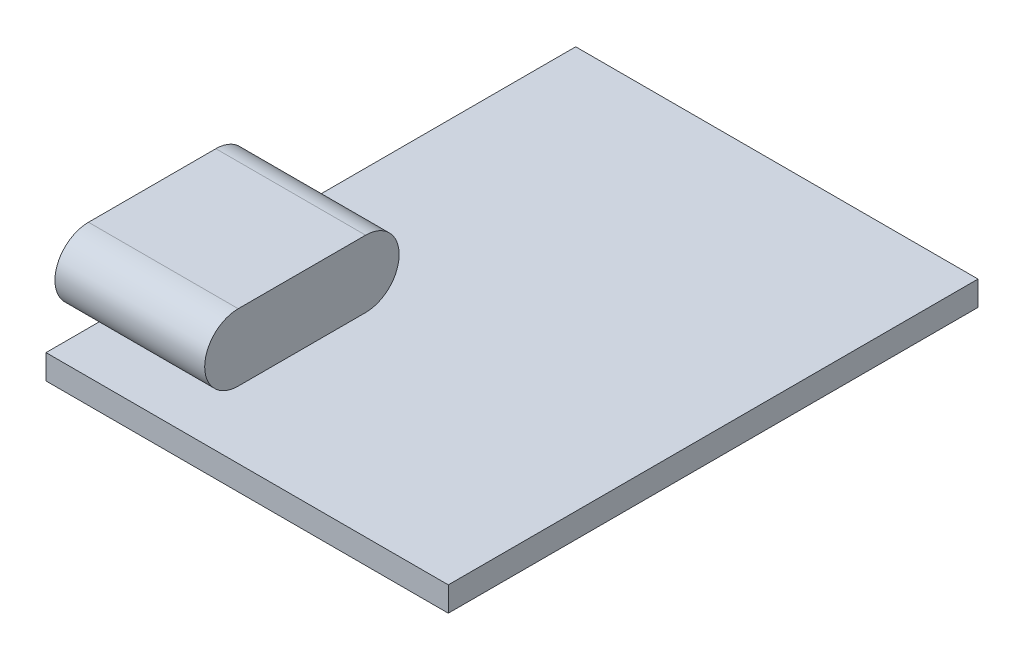
ISO-10303-21;
HEADER;
FILE_DESCRIPTION(('STEP AP214'),'2;1');
FILE_NAME('part.step','',(''),(''),'','','');
FILE_SCHEMA(('AUTOMOTIVE_DESIGN { 1 0 10303 214 1 1 1 1 }'));
ENDSEC;
DATA;
#1=APPLICATION_CONTEXT('core data for automotive mechanical design processes');
#2=APPLICATION_PROTOCOL_DEFINITION('international standard','automotive_design',2000,#1);
#3=PRODUCT_CONTEXT('',#1,'mechanical');
#4=PRODUCT('Part','Part','',(#3));
#5=PRODUCT_RELATED_PRODUCT_CATEGORY('part','',(#4));
#6=PRODUCT_DEFINITION_FORMATION('','',#4);
#7=PRODUCT_DEFINITION_CONTEXT('part definition',#1,'design');
#8=PRODUCT_DEFINITION('design','',#6,#7);
#9=PRODUCT_DEFINITION_SHAPE('','',#8);
#10=(LENGTH_UNIT() NAMED_UNIT(*) SI_UNIT(.MILLI.,.METRE.));
#11=(NAMED_UNIT(*) PLANE_ANGLE_UNIT() SI_UNIT($,.RADIAN.));
#12=(NAMED_UNIT(*) SI_UNIT($,.STERADIAN.) SOLID_ANGLE_UNIT());
#13=UNCERTAINTY_MEASURE_WITH_UNIT(LENGTH_MEASURE(1.E-05),#10,'distance_accuracy_value','');
#14=(GEOMETRIC_REPRESENTATION_CONTEXT(3) GLOBAL_UNCERTAINTY_ASSIGNED_CONTEXT((#13)) GLOBAL_UNIT_ASSIGNED_CONTEXT((#10,
#11,#12)) REPRESENTATION_CONTEXT('',''));
#15=CARTESIAN_POINT('',(0.,0.,0.));
#16=DIRECTION('',(0.,0.,1.));
#17=DIRECTION('',(1.,0.,0.));
#18=AXIS2_PLACEMENT_3D('',#15,#16,#17);
#19=CARTESIAN_POINT('',(0.,1.1,0.));
#20=DIRECTION('',(0.,-1.,0.));
#21=DIRECTION('',(0.,0.,-1.));
#22=AXIS2_PLACEMENT_3D('',#19,#20,#21);
#23=PLANE('',#22);
#24=DIRECTION('',(-1.,0.,0.));
#25=VECTOR('',#24,1.);
#26=CARTESIAN_POINT('',(5.6,1.1,-8.7));
#27=LINE('',#26,#25);
#28=CARTESIAN_POINT('',(5.6,1.1,-8.7));
#29=VERTEX_POINT('',#28);
#30=CARTESIAN_POINT('',(0.,1.1,-8.7));
#31=VERTEX_POINT('',#30);
#32=EDGE_CURVE('E113',#29,#31,#27,.T.);
#33=ORIENTED_EDGE('',*,*,#32,.F.);
#34=DIRECTION('',(0.,0.,1.));
#35=VECTOR('',#34,1.);
#36=CARTESIAN_POINT('',(5.6,1.1,-8.7));
#37=LINE('',#36,#35);
#38=CARTESIAN_POINT('',(5.6,1.1,-3.));
#39=VERTEX_POINT('',#38);
#40=EDGE_CURVE('E52',#29,#39,#37,.T.);
#41=ORIENTED_EDGE('',*,*,#40,.T.);
#42=DIRECTION('',(-1.,0.,0.));
#43=VECTOR('',#42,1.);
#44=CARTESIAN_POINT('',(5.6,1.1,-3.));
#45=LINE('',#44,#43);
#46=CARTESIAN_POINT('',(0.,1.1,-3.));
#47=VERTEX_POINT('',#46);
#48=EDGE_CURVE('E56',#39,#47,#45,.T.);
#49=ORIENTED_EDGE('',*,*,#48,.T.);
#50=DIRECTION('',(0.,0.,1.));
#51=VECTOR('',#50,1.);
#52=CARTESIAN_POINT('',(0.,1.1,0.));
#53=LINE('',#52,#51);
#54=CARTESIAN_POINT('',(0.,1.1,0.));
#55=VERTEX_POINT('',#54);
#56=EDGE_CURVE('E155',#47,#55,#53,.T.);
#57=ORIENTED_EDGE('',*,*,#56,.T.);
#58=DIRECTION('',(1.,0.,0.));
#59=VECTOR('',#58,1.);
#60=CARTESIAN_POINT('',(0.,1.1,0.));
#61=LINE('',#60,#59);
#62=CARTESIAN_POINT('',(18.,1.1,0.));
#63=VERTEX_POINT('',#62);
#64=EDGE_CURVE('E153',#55,#63,#61,.T.);
#65=ORIENTED_EDGE('',*,*,#64,.T.);
#66=DIRECTION('',(0.,0.,-1.));
#67=VECTOR('',#66,1.);
#68=CARTESIAN_POINT('',(18.,1.1,0.));
#69=LINE('',#68,#67);
#70=CARTESIAN_POINT('',(18.,1.1,-23.7));
#71=VERTEX_POINT('',#70);
#72=EDGE_CURVE('E157',#63,#71,#69,.T.);
#73=ORIENTED_EDGE('',*,*,#72,.T.);
#74=DIRECTION('',(-1.,0.,0.));
#75=VECTOR('',#74,1.);
#76=CARTESIAN_POINT('',(0.,1.1,-23.7));
#77=LINE('',#76,#75);
#78=CARTESIAN_POINT('',(0.,1.1,-23.7));
#79=VERTEX_POINT('',#78);
#80=EDGE_CURVE('E159',#71,#79,#77,.T.);
#81=ORIENTED_EDGE('',*,*,#80,.T.);
#82=EDGE_CURVE('E150',#79,#31,#53,.T.);
#83=ORIENTED_EDGE('',*,*,#82,.T.);
#84=EDGE_LOOP('',(#33,#41,#49,#57,#65,#73,#81,#83));
#85=FACE_BOUND('',#84,.T.);
#86=ADVANCED_FACE('F37',(#85),#23,.F.);
#87=CARTESIAN_POINT('',(0.,1.1,0.));
#88=DIRECTION('',(1.,0.,0.));
#89=DIRECTION('',(0.,0.,-1.));
#90=AXIS2_PLACEMENT_3D('',#87,#88,#89);
#91=PLANE('',#90);
#92=DIRECTION('',(0.,0.,1.));
#93=VECTOR('',#92,1.);
#94=CARTESIAN_POINT('',(0.,0.,0.));
#95=LINE('',#94,#93);
#96=CARTESIAN_POINT('',(0.,0.,-23.7));
#97=VERTEX_POINT('',#96);
#98=CARTESIAN_POINT('',(0.,0.,0.));
#99=VERTEX_POINT('',#98);
#100=EDGE_CURVE('E146',#97,#99,#95,.T.);
#101=ORIENTED_EDGE('',*,*,#100,.T.);
#102=DIRECTION('',(0.,-1.,0.));
#103=VECTOR('',#102,1.);
#104=CARTESIAN_POINT('',(0.,1.1,0.));
#105=LINE('',#104,#103);
#106=EDGE_CURVE('E11',#55,#99,#105,.T.);
#107=ORIENTED_EDGE('',*,*,#106,.F.);
#108=ORIENTED_EDGE('',*,*,#56,.F.);
#109=EDGE_CURVE('E154',#31,#47,#53,.T.);
#110=ORIENTED_EDGE('',*,*,#109,.F.);
#111=ORIENTED_EDGE('',*,*,#82,.F.);
#112=DIRECTION('',(0.,-1.,0.));
#113=VECTOR('',#112,1.);
#114=CARTESIAN_POINT('',(0.,1.1,-23.7));
#115=LINE('',#114,#113);
#116=EDGE_CURVE('E161',#79,#97,#115,.T.);
#117=ORIENTED_EDGE('',*,*,#116,.T.);
#118=EDGE_LOOP('',(#101,#107,#108,#110,#111,#117));
#119=FACE_BOUND('',#118,.T.);
#120=ADVANCED_FACE('F39',(#119),#91,.F.);
#121=CARTESIAN_POINT('',(0.,1.1,0.));
#122=DIRECTION('',(0.,0.,-1.));
#123=DIRECTION('',(-1.,0.,0.));
#124=AXIS2_PLACEMENT_3D('',#121,#122,#123);
#125=PLANE('',#124);
#126=DIRECTION('',(1.,0.,0.));
#127=VECTOR('',#126,1.);
#128=CARTESIAN_POINT('',(0.,0.,0.));
#129=LINE('',#128,#127);
#130=CARTESIAN_POINT('',(18.,0.,0.));
#131=VERTEX_POINT('',#130);
#132=EDGE_CURVE('E164',#99,#131,#129,.T.);
#133=ORIENTED_EDGE('',*,*,#132,.T.);
#134=DIRECTION('',(0.,-1.,0.));
#135=VECTOR('',#134,1.);
#136=CARTESIAN_POINT('',(18.,1.1,0.));
#137=LINE('',#136,#135);
#138=EDGE_CURVE('E45',#63,#131,#137,.T.);
#139=ORIENTED_EDGE('',*,*,#138,.F.);
#140=ORIENTED_EDGE('',*,*,#64,.F.);
#141=ORIENTED_EDGE('',*,*,#106,.T.);
#142=EDGE_LOOP('',(#133,#139,#140,#141));
#143=FACE_BOUND('',#142,.T.);
#144=ADVANCED_FACE('F194',(#143),#125,.F.);
#145=CARTESIAN_POINT('',(18.,1.1,0.));
#146=DIRECTION('',(-1.,0.,0.));
#147=DIRECTION('',(0.,0.,1.));
#148=AXIS2_PLACEMENT_3D('',#145,#146,#147);
#149=PLANE('',#148);
#150=DIRECTION('',(0.,0.,-1.));
#151=VECTOR('',#150,1.);
#152=CARTESIAN_POINT('',(18.,0.,0.));
#153=LINE('',#152,#151);
#154=CARTESIAN_POINT('',(18.,0.,-23.7));
#155=VERTEX_POINT('',#154);
#156=EDGE_CURVE('E166',#131,#155,#153,.T.);
#157=ORIENTED_EDGE('',*,*,#156,.T.);
#158=DIRECTION('',(0.,-1.,0.));
#159=VECTOR('',#158,1.);
#160=CARTESIAN_POINT('',(18.,1.1,-23.7));
#161=LINE('',#160,#159);
#162=EDGE_CURVE('E172',#71,#155,#161,.T.);
#163=ORIENTED_EDGE('',*,*,#162,.F.);
#164=ORIENTED_EDGE('',*,*,#72,.F.);
#165=ORIENTED_EDGE('',*,*,#138,.T.);
#166=EDGE_LOOP('',(#157,#163,#164,#165));
#167=FACE_BOUND('',#166,.T.);
#168=ADVANCED_FACE('F179',(#167),#149,.F.);
#169=CARTESIAN_POINT('',(0.,1.1,-23.7));
#170=DIRECTION('',(0.,0.,1.));
#171=DIRECTION('',(1.,0.,0.));
#172=AXIS2_PLACEMENT_3D('',#169,#170,#171);
#173=PLANE('',#172);
#174=DIRECTION('',(-1.,0.,0.));
#175=VECTOR('',#174,1.);
#176=CARTESIAN_POINT('',(0.,0.,-23.7));
#177=LINE('',#176,#175);
#178=EDGE_CURVE('E168',#155,#97,#177,.T.);
#179=ORIENTED_EDGE('',*,*,#178,.T.);
#180=ORIENTED_EDGE('',*,*,#116,.F.);
#181=ORIENTED_EDGE('',*,*,#80,.F.);
#182=ORIENTED_EDGE('',*,*,#162,.T.);
#183=EDGE_LOOP('',(#179,#180,#181,#182));
#184=FACE_BOUND('',#183,.T.);
#185=ADVANCED_FACE('F189',(#184),#173,.F.);
#186=CARTESIAN_POINT('',(0.,0.,0.));
#187=DIRECTION('',(0.,-1.,0.));
#188=DIRECTION('',(0.,0.,-1.));
#189=AXIS2_PLACEMENT_3D('',#186,#187,#188);
#190=PLANE('',#189);
#191=ORIENTED_EDGE('',*,*,#100,.F.);
#192=ORIENTED_EDGE('',*,*,#178,.F.);
#193=ORIENTED_EDGE('',*,*,#156,.F.);
#194=ORIENTED_EDGE('',*,*,#132,.F.);
#195=EDGE_LOOP('',(#191,#192,#193,#194));
#196=FACE_BOUND('',#195,.T.);
#197=ADVANCED_FACE('F186',(#196),#190,.T.);
#198=CARTESIAN_POINT('',(5.6,1.1,-8.7));
#199=DIRECTION('',(0.,-1.,0.));
#200=DIRECTION('',(0.,0.,-1.));
#201=AXIS2_PLACEMENT_3D('',#198,#199,#200);
#202=PLANE('',#201);
#203=ORIENTED_EDGE('',*,*,#109,.T.);
#204=CARTESIAN_POINT('',(-1.1,1.1,-3.));
#205=VERTEX_POINT('',#204);
#206=EDGE_CURVE('E122',#47,#205,#45,.T.);
#207=ORIENTED_EDGE('',*,*,#206,.T.);
#208=DIRECTION('',(0.,0.,1.));
#209=VECTOR('',#208,1.);
#210=CARTESIAN_POINT('',(-1.1,1.1,-8.7));
#211=LINE('',#210,#209);
#212=CARTESIAN_POINT('',(-1.1,1.1,-8.7));
#213=VERTEX_POINT('',#212);
#214=EDGE_CURVE('E119',#213,#205,#211,.T.);
#215=ORIENTED_EDGE('',*,*,#214,.F.);
#216=EDGE_CURVE('E107',#31,#213,#27,.T.);
#217=ORIENTED_EDGE('',*,*,#216,.F.);
#218=EDGE_LOOP('',(#203,#207,#215,#217));
#219=FACE_BOUND('',#218,.T.);
#220=ADVANCED_FACE('F120',(#219),#202,.T.);
#221=CARTESIAN_POINT('',(5.6,2.6,-8.7));
#222=DIRECTION('',(-1.,0.,0.));
#223=DIRECTION('',(0.,0.,1.));
#224=AXIS2_PLACEMENT_3D('',#221,#222,#223);
#225=CYLINDRICAL_SURFACE('',#224,1.5);
#226=ORIENTED_EDGE('',*,*,#32,.T.);
#227=ORIENTED_EDGE('',*,*,#216,.T.);
#228=CARTESIAN_POINT('',(-1.1,2.6,-8.7));
#229=DIRECTION('',(-1.,0.,0.));
#230=DIRECTION('',(0.,0.,1.));
#231=AXIS2_PLACEMENT_3D('',#228,#229,#230);
#232=CIRCLE('',#231,1.5);
#233=CARTESIAN_POINT('',(-1.1,4.1,-8.7));
#234=VERTEX_POINT('',#233);
#235=EDGE_CURVE('E111',#234,#213,#232,.T.);
#236=ORIENTED_EDGE('',*,*,#235,.F.);
#237=DIRECTION('',(-1.,0.,0.));
#238=VECTOR('',#237,1.);
#239=CARTESIAN_POINT('',(5.6,4.1,-8.7));
#240=LINE('',#239,#238);
#241=CARTESIAN_POINT('',(5.6,4.1,-8.7));
#242=VERTEX_POINT('',#241);
#243=EDGE_CURVE('E144',#242,#234,#240,.T.);
#244=ORIENTED_EDGE('',*,*,#243,.F.);
#245=CARTESIAN_POINT('',(5.6,2.6,-8.7));
#246=DIRECTION('',(-1.,0.,0.));
#247=DIRECTION('',(0.,0.,1.));
#248=AXIS2_PLACEMENT_3D('',#245,#246,#247);
#249=CIRCLE('',#248,1.5);
#250=EDGE_CURVE('E136',#242,#29,#249,.T.);
#251=ORIENTED_EDGE('',*,*,#250,.T.);
#252=EDGE_LOOP('',(#226,#227,#236,#244,#251));
#253=FACE_BOUND('',#252,.T.);
#254=ADVANCED_FACE('F109',(#253),#225,.T.);
#255=CARTESIAN_POINT('',(5.6,4.1,-8.7));
#256=DIRECTION('',(0.,1.,0.));
#257=DIRECTION('',(0.,0.,1.));
#258=AXIS2_PLACEMENT_3D('',#255,#256,#257);
#259=PLANE('',#258);
#260=ORIENTED_EDGE('',*,*,#243,.T.);
#261=DIRECTION('',(0.,0.,-1.));
#262=VECTOR('',#261,1.);
#263=CARTESIAN_POINT('',(-1.1,4.1,-8.7));
#264=LINE('',#263,#262);
#265=CARTESIAN_POINT('',(-1.1,4.1,-3.));
#266=VERTEX_POINT('',#265);
#267=EDGE_CURVE('E131',#266,#234,#264,.T.);
#268=ORIENTED_EDGE('',*,*,#267,.F.);
#269=DIRECTION('',(-1.,0.,0.));
#270=VECTOR('',#269,1.);
#271=CARTESIAN_POINT('',(5.6,4.1,-3.));
#272=LINE('',#271,#270);
#273=CARTESIAN_POINT('',(5.6,4.1,-3.));
#274=VERTEX_POINT('',#273);
#275=EDGE_CURVE('E147',#274,#266,#272,.T.);
#276=ORIENTED_EDGE('',*,*,#275,.F.);
#277=DIRECTION('',(0.,0.,-1.));
#278=VECTOR('',#277,1.);
#279=CARTESIAN_POINT('',(5.6,4.1,-8.7));
#280=LINE('',#279,#278);
#281=EDGE_CURVE('E116',#274,#242,#280,.T.);
#282=ORIENTED_EDGE('',*,*,#281,.T.);
#283=EDGE_LOOP('',(#260,#268,#276,#282));
#284=FACE_BOUND('',#283,.T.);
#285=ADVANCED_FACE('F199',(#284),#259,.T.);
#286=CARTESIAN_POINT('',(5.6,2.6,-3.));
#287=DIRECTION('',(-1.,0.,0.));
#288=DIRECTION('',(0.,0.,1.));
#289=AXIS2_PLACEMENT_3D('',#286,#287,#288);
#290=CYLINDRICAL_SURFACE('',#289,1.5);
#291=ORIENTED_EDGE('',*,*,#275,.T.);
#292=CARTESIAN_POINT('',(-1.1,2.6,-3.));
#293=DIRECTION('',(-1.,0.,0.));
#294=DIRECTION('',(0.,0.,1.));
#295=AXIS2_PLACEMENT_3D('',#292,#293,#294);
#296=CIRCLE('',#295,1.5);
#297=EDGE_CURVE('E126',#205,#266,#296,.T.);
#298=ORIENTED_EDGE('',*,*,#297,.F.);
#299=ORIENTED_EDGE('',*,*,#206,.F.);
#300=ORIENTED_EDGE('',*,*,#48,.F.);
#301=CARTESIAN_POINT('',(5.6,2.6,-3.));
#302=DIRECTION('',(-1.,0.,0.));
#303=DIRECTION('',(0.,0.,1.));
#304=AXIS2_PLACEMENT_3D('',#301,#302,#303);
#305=CIRCLE('',#304,1.5);
#306=EDGE_CURVE('E139',#39,#274,#305,.T.);
#307=ORIENTED_EDGE('',*,*,#306,.T.);
#308=EDGE_LOOP('',(#291,#298,#299,#300,#307));
#309=FACE_BOUND('',#308,.T.);
#310=ADVANCED_FACE('F196',(#309),#290,.T.);
#311=CARTESIAN_POINT('',(5.6,2.6,-8.7));
#312=DIRECTION('',(-1.,0.,0.));
#313=DIRECTION('',(0.,0.,1.));
#314=AXIS2_PLACEMENT_3D('',#311,#312,#313);
#315=PLANE('',#314);
#316=ORIENTED_EDGE('',*,*,#250,.F.);
#317=ORIENTED_EDGE('',*,*,#281,.F.);
#318=ORIENTED_EDGE('',*,*,#306,.F.);
#319=ORIENTED_EDGE('',*,*,#40,.F.);
#320=EDGE_LOOP('',(#316,#317,#318,#319));
#321=FACE_BOUND('',#320,.T.);
#322=ADVANCED_FACE('F203',(#321),#315,.F.);
#323=CARTESIAN_POINT('',(-1.1,2.6,-8.7));
#324=DIRECTION('',(-1.,0.,0.));
#325=DIRECTION('',(0.,0.,1.));
#326=AXIS2_PLACEMENT_3D('',#323,#324,#325);
#327=PLANE('',#326);
#328=ORIENTED_EDGE('',*,*,#235,.T.);
#329=ORIENTED_EDGE('',*,*,#214,.T.);
#330=ORIENTED_EDGE('',*,*,#297,.T.);
#331=ORIENTED_EDGE('',*,*,#267,.T.);
#332=EDGE_LOOP('',(#328,#329,#330,#331));
#333=FACE_BOUND('',#332,.T.);
#334=ADVANCED_FACE('F129',(#333),#327,.T.);
#335=CLOSED_SHELL('',(#86,#120,#144,#168,#185,#197,#220,#254,#285,#310,#322,#334));
#336=MANIFOLD_SOLID_BREP('B2',#335);
#337=ADVANCED_BREP_SHAPE_REPRESENTATION('',(#18,#336),#14);
#338=SHAPE_DEFINITION_REPRESENTATION(#9,#337);
ENDSEC;
END-ISO-10303-21;
